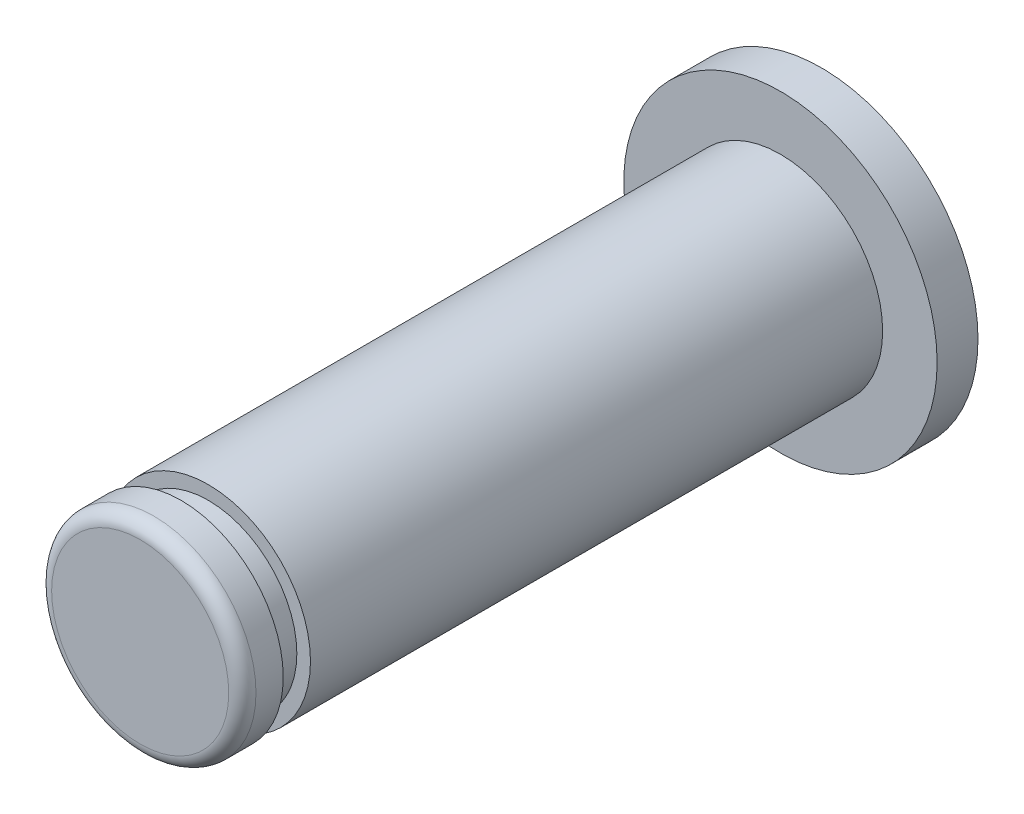
ISO-10303-21;
HEADER;
FILE_DESCRIPTION(('STEP AP214'),'2;1');
FILE_NAME('part.step','',(''),(''),'','','');
FILE_SCHEMA(('AUTOMOTIVE_DESIGN { 1 0 10303 214 1 1 1 1 }'));
ENDSEC;
DATA;
#1=APPLICATION_CONTEXT('core data for automotive mechanical design processes');
#2=APPLICATION_PROTOCOL_DEFINITION('international standard','automotive_design',2000,#1);
#3=PRODUCT_CONTEXT('',#1,'mechanical');
#4=PRODUCT('Part','Part','',(#3));
#5=PRODUCT_RELATED_PRODUCT_CATEGORY('part','',(#4));
#6=PRODUCT_DEFINITION_FORMATION('','',#4);
#7=PRODUCT_DEFINITION_CONTEXT('part definition',#1,'design');
#8=PRODUCT_DEFINITION('design','',#6,#7);
#9=PRODUCT_DEFINITION_SHAPE('','',#8);
#10=(LENGTH_UNIT() NAMED_UNIT(*) SI_UNIT(.MILLI.,.METRE.));
#11=(NAMED_UNIT(*) PLANE_ANGLE_UNIT() SI_UNIT($,.RADIAN.));
#12=(NAMED_UNIT(*) SI_UNIT($,.STERADIAN.) SOLID_ANGLE_UNIT());
#13=UNCERTAINTY_MEASURE_WITH_UNIT(LENGTH_MEASURE(1.E-05),#10,'distance_accuracy_value','');
#14=(GEOMETRIC_REPRESENTATION_CONTEXT(3) GLOBAL_UNCERTAINTY_ASSIGNED_CONTEXT((#13)) GLOBAL_UNIT_ASSIGNED_CONTEXT((#10,
#11,#12)) REPRESENTATION_CONTEXT('',''));
#15=CARTESIAN_POINT('',(0.,0.,0.));
#16=DIRECTION('',(0.,0.,1.));
#17=DIRECTION('',(1.,0.,0.));
#18=AXIS2_PLACEMENT_3D('',#15,#16,#17);
#19=CARTESIAN_POINT('',(0.,0.,45.));
#20=DIRECTION('',(0.,0.,-1.));
#21=DIRECTION('',(-1.,0.,0.));
#22=AXIS2_PLACEMENT_3D('',#19,#20,#21);
#23=CYLINDRICAL_SURFACE('',#22,7.5);
#24=CARTESIAN_POINT('',(0.,0.,3.));
#25=DIRECTION('',(0.,0.,1.));
#26=DIRECTION('',(1.,0.,0.));
#27=AXIS2_PLACEMENT_3D('',#24,#25,#26);
#28=CIRCLE('',#27,7.5);
#29=CARTESIAN_POINT('',(7.5,0.,3.));
#30=VERTEX_POINT('',#29);
#31=EDGE_CURVE('E49',#30,#30,#28,.T.);
#32=ORIENTED_EDGE('',*,*,#31,.T.);
#33=EDGE_LOOP('',(#32));
#34=FACE_BOUND('',#33,.T.);
#35=CARTESIAN_POINT('',(0.,0.,45.));
#36=DIRECTION('',(0.,0.,1.));
#37=DIRECTION('',(1.,0.,0.));
#38=AXIS2_PLACEMENT_3D('',#35,#36,#37);
#39=CIRCLE('',#38,7.5);
#40=CARTESIAN_POINT('',(7.5,0.,45.));
#41=VERTEX_POINT('',#40);
#42=EDGE_CURVE('E46',#41,#41,#39,.T.);
#43=ORIENTED_EDGE('',*,*,#42,.F.);
#44=EDGE_LOOP('',(#43));
#45=FACE_BOUND('',#44,.T.);
#46=ADVANCED_FACE('F31',(#34,#45),#23,.T.);
#47=CARTESIAN_POINT('',(0.,0.,45.));
#48=DIRECTION('',(0.,0.,1.));
#49=DIRECTION('',(1.,0.,0.));
#50=AXIS2_PLACEMENT_3D('',#47,#48,#49);
#51=PLANE('',#50);
#52=CARTESIAN_POINT('',(0.,0.,45.));
#53=DIRECTION('',(0.,0.,1.));
#54=DIRECTION('',(1.,0.,0.));
#55=AXIS2_PLACEMENT_3D('',#52,#53,#54);
#56=CIRCLE('',#55,6.5);
#57=CARTESIAN_POINT('',(6.5,0.,45.));
#58=VERTEX_POINT('',#57);
#59=EDGE_CURVE('E42',#58,#58,#56,.T.);
#60=ORIENTED_EDGE('',*,*,#59,.F.);
#61=EDGE_LOOP('',(#60));
#62=FACE_BOUND('',#61,.T.);
#63=ORIENTED_EDGE('',*,*,#42,.T.);
#64=EDGE_LOOP('',(#63));
#65=FACE_BOUND('',#64,.T.);
#66=ADVANCED_FACE('F83',(#62,#65),#51,.T.);
#67=CARTESIAN_POINT('',(0.,0.,3.));
#68=DIRECTION('',(0.,0.,-1.));
#69=DIRECTION('',(-1.,0.,0.));
#70=AXIS2_PLACEMENT_3D('',#67,#68,#69);
#71=CYLINDRICAL_SURFACE('',#70,11.5);
#72=CARTESIAN_POINT('',(0.,0.,3.));
#73=DIRECTION('',(0.,0.,1.));
#74=DIRECTION('',(1.,0.,0.));
#75=AXIS2_PLACEMENT_3D('',#72,#73,#74);
#76=CIRCLE('',#75,11.5);
#77=CARTESIAN_POINT('',(11.5,0.,3.));
#78=VERTEX_POINT('',#77);
#79=EDGE_CURVE('E52',#78,#78,#76,.T.);
#80=ORIENTED_EDGE('',*,*,#79,.F.);
#81=EDGE_LOOP('',(#80));
#82=FACE_BOUND('',#81,.T.);
#83=CARTESIAN_POINT('',(0.,0.,0.));
#84=DIRECTION('',(0.,0.,1.));
#85=DIRECTION('',(1.,0.,0.));
#86=AXIS2_PLACEMENT_3D('',#83,#84,#85);
#87=CIRCLE('',#86,11.5);
#88=CARTESIAN_POINT('',(11.5,0.,0.));
#89=VERTEX_POINT('',#88);
#90=EDGE_CURVE('E55',#89,#89,#87,.T.);
#91=ORIENTED_EDGE('',*,*,#90,.T.);
#92=EDGE_LOOP('',(#91));
#93=FACE_BOUND('',#92,.T.);
#94=ADVANCED_FACE('F88',(#82,#93),#71,.T.);
#95=CARTESIAN_POINT('',(0.,0.,3.));
#96=DIRECTION('',(0.,0.,1.));
#97=DIRECTION('',(1.,0.,0.));
#98=AXIS2_PLACEMENT_3D('',#95,#96,#97);
#99=PLANE('',#98);
#100=ORIENTED_EDGE('',*,*,#31,.F.);
#101=EDGE_LOOP('',(#100));
#102=FACE_BOUND('',#101,.T.);
#103=ORIENTED_EDGE('',*,*,#79,.T.);
#104=EDGE_LOOP('',(#103));
#105=FACE_BOUND('',#104,.T.);
#106=ADVANCED_FACE('F96',(#102,#105),#99,.T.);
#107=CARTESIAN_POINT('',(0.,0.,0.));
#108=DIRECTION('',(0.,0.,1.));
#109=DIRECTION('',(1.,0.,0.));
#110=AXIS2_PLACEMENT_3D('',#107,#108,#109);
#111=PLANE('',#110);
#112=ORIENTED_EDGE('',*,*,#90,.F.);
#113=EDGE_LOOP('',(#112));
#114=FACE_BOUND('',#113,.T.);
#115=ADVANCED_FACE('F93',(#114),#111,.F.);
#116=CARTESIAN_POINT('',(0.,0.,47.));
#117=DIRECTION('',(0.,0.,-1.));
#118=DIRECTION('',(-1.,0.,0.));
#119=AXIS2_PLACEMENT_3D('',#116,#117,#118);
#120=CYLINDRICAL_SURFACE('',#119,6.5);
#121=CARTESIAN_POINT('',(0.,0.,47.));
#122=DIRECTION('',(0.,0.,1.));
#123=DIRECTION('',(1.,0.,0.));
#124=AXIS2_PLACEMENT_3D('',#121,#122,#123);
#125=CIRCLE('',#124,6.5);
#126=CARTESIAN_POINT('',(6.5,0.,47.));
#127=VERTEX_POINT('',#126);
#128=EDGE_CURVE('E58',#127,#127,#125,.T.);
#129=ORIENTED_EDGE('',*,*,#128,.F.);
#130=EDGE_LOOP('',(#129));
#131=FACE_BOUND('',#130,.T.);
#132=ORIENTED_EDGE('',*,*,#59,.T.);
#133=EDGE_LOOP('',(#132));
#134=FACE_BOUND('',#133,.T.);
#135=ADVANCED_FACE('F95',(#131,#134),#120,.T.);
#136=CARTESIAN_POINT('',(0.,0.,50.));
#137=DIRECTION('',(0.,0.,-1.));
#138=DIRECTION('',(-1.,0.,0.));
#139=AXIS2_PLACEMENT_3D('',#136,#137,#138);
#140=CYLINDRICAL_SURFACE('',#139,7.5);
#141=CARTESIAN_POINT('',(0.,0.,49.));
#142=DIRECTION('',(0.,0.,1.));
#143=DIRECTION('',(1.,0.,0.));
#144=AXIS2_PLACEMENT_3D('',#141,#142,#143);
#145=CIRCLE('',#144,7.5);
#146=CARTESIAN_POINT('',(7.5,0.,49.));
#147=VERTEX_POINT('',#146);
#148=EDGE_CURVE('E10',#147,#147,#145,.F.);
#149=ORIENTED_EDGE('',*,*,#148,.T.);
#150=EDGE_LOOP('',(#149));
#151=FACE_BOUND('',#150,.T.);
#152=CARTESIAN_POINT('',(0.,0.,47.));
#153=DIRECTION('',(0.,0.,1.));
#154=DIRECTION('',(1.,0.,0.));
#155=AXIS2_PLACEMENT_3D('',#152,#153,#154);
#156=CIRCLE('',#155,7.5);
#157=CARTESIAN_POINT('',(7.5,0.,47.));
#158=VERTEX_POINT('',#157);
#159=EDGE_CURVE('E63',#158,#158,#156,.T.);
#160=ORIENTED_EDGE('',*,*,#159,.T.);
#161=EDGE_LOOP('',(#160));
#162=FACE_BOUND('',#161,.T.);
#163=ADVANCED_FACE('F67',(#151,#162),#140,.T.);
#164=CARTESIAN_POINT('',(0.,0.,50.));
#165=DIRECTION('',(0.,0.,1.));
#166=DIRECTION('',(1.,0.,0.));
#167=AXIS2_PLACEMENT_3D('',#164,#165,#166);
#168=PLANE('',#167);
#169=CARTESIAN_POINT('',(0.,0.,50.));
#170=DIRECTION('',(0.,0.,1.));
#171=DIRECTION('',(1.,0.,0.));
#172=AXIS2_PLACEMENT_3D('',#169,#170,#171);
#173=CIRCLE('',#172,6.5);
#174=CARTESIAN_POINT('',(6.5,0.,50.));
#175=VERTEX_POINT('',#174);
#176=EDGE_CURVE('E38',#175,#175,#173,.T.);
#177=ORIENTED_EDGE('',*,*,#176,.T.);
#178=EDGE_LOOP('',(#177));
#179=FACE_BOUND('',#178,.T.);
#180=ADVANCED_FACE('F71',(#179),#168,.T.);
#181=CARTESIAN_POINT('',(0.,0.,47.));
#182=DIRECTION('',(0.,0.,1.));
#183=DIRECTION('',(1.,0.,0.));
#184=AXIS2_PLACEMENT_3D('',#181,#182,#183);
#185=PLANE('',#184);
#186=ORIENTED_EDGE('',*,*,#128,.T.);
#187=EDGE_LOOP('',(#186));
#188=FACE_BOUND('',#187,.T.);
#189=ORIENTED_EDGE('',*,*,#159,.F.);
#190=EDGE_LOOP('',(#189));
#191=FACE_BOUND('',#190,.T.);
#192=ADVANCED_FACE('F69',(#188,#191),#185,.F.);
#193=CARTESIAN_POINT('',(0.,0.,49.));
#194=DIRECTION('',(0.,0.,1.));
#195=DIRECTION('',(1.,0.,0.));
#196=AXIS2_PLACEMENT_3D('',#193,#194,#195);
#197=TOROIDAL_SURFACE('',#196,6.5,1.);
#198=ORIENTED_EDGE('',*,*,#148,.F.);
#199=EDGE_LOOP('',(#198));
#200=FACE_BOUND('',#199,.T.);
#201=ORIENTED_EDGE('',*,*,#176,.F.);
#202=EDGE_LOOP('',(#201));
#203=FACE_BOUND('',#202,.T.);
#204=ADVANCED_FACE('F33',(#200,#203),#197,.T.);
#205=CLOSED_SHELL('',(#46,#66,#94,#106,#115,#135,#163,#180,#192,#204));
#206=MANIFOLD_SOLID_BREP('B2',#205);
#207=ADVANCED_BREP_SHAPE_REPRESENTATION('',(#18,#206),#14);
#208=SHAPE_DEFINITION_REPRESENTATION(#9,#207);
ENDSEC;
END-ISO-10303-21;
